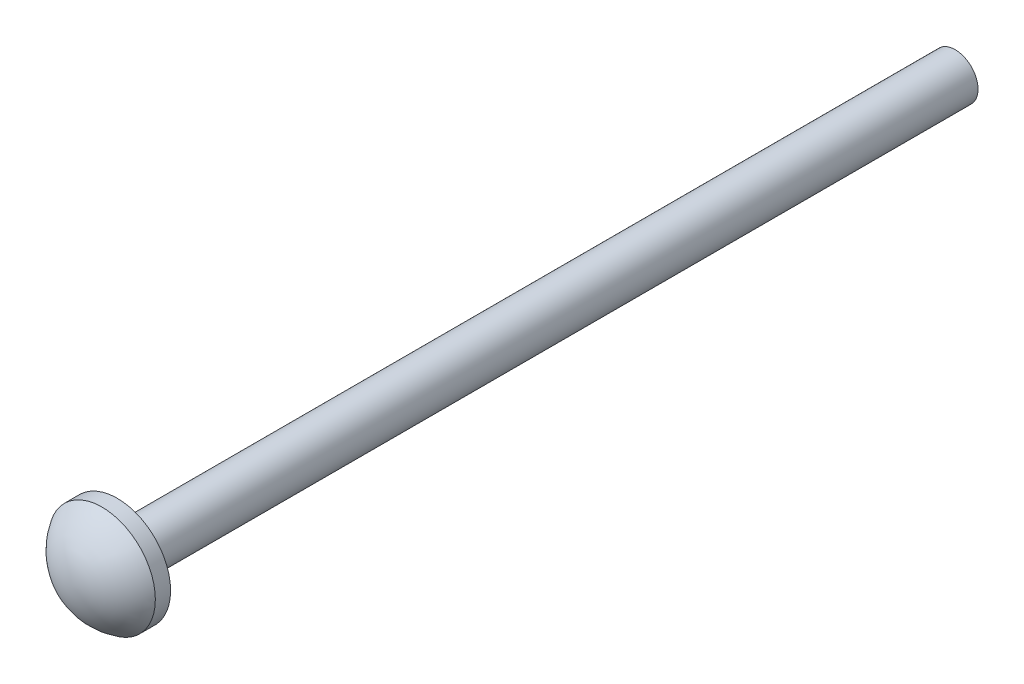
ISO-10303-21;
HEADER;
FILE_DESCRIPTION(('STEP AP214'),'2;1');
FILE_NAME('part.step','',(''),(''),'','','');
FILE_SCHEMA(('AUTOMOTIVE_DESIGN { 1 0 10303 214 1 1 1 1 }'));
ENDSEC;
DATA;
#1=APPLICATION_CONTEXT('core data for automotive mechanical design processes');
#2=APPLICATION_PROTOCOL_DEFINITION('international standard','automotive_design',2000,#1);
#3=PRODUCT_CONTEXT('',#1,'mechanical');
#4=PRODUCT('Part','Part','',(#3));
#5=PRODUCT_RELATED_PRODUCT_CATEGORY('part','',(#4));
#6=PRODUCT_DEFINITION_FORMATION('','',#4);
#7=PRODUCT_DEFINITION_CONTEXT('part definition',#1,'design');
#8=PRODUCT_DEFINITION('design','',#6,#7);
#9=PRODUCT_DEFINITION_SHAPE('','',#8);
#10=(LENGTH_UNIT() NAMED_UNIT(*) SI_UNIT(.MILLI.,.METRE.));
#11=(NAMED_UNIT(*) PLANE_ANGLE_UNIT() SI_UNIT($,.RADIAN.));
#12=(NAMED_UNIT(*) SI_UNIT($,.STERADIAN.) SOLID_ANGLE_UNIT());
#13=UNCERTAINTY_MEASURE_WITH_UNIT(LENGTH_MEASURE(1.E-05),#10,'distance_accuracy_value','');
#14=(GEOMETRIC_REPRESENTATION_CONTEXT(3) GLOBAL_UNCERTAINTY_ASSIGNED_CONTEXT((#13)) GLOBAL_UNIT_ASSIGNED_CONTEXT((#10,
#11,#12)) REPRESENTATION_CONTEXT('',''));
#15=CARTESIAN_POINT('',(0.,0.,0.));
#16=DIRECTION('',(0.,0.,1.));
#17=DIRECTION('',(1.,0.,0.));
#18=AXIS2_PLACEMENT_3D('',#15,#16,#17);
#19=CARTESIAN_POINT('',(0.,0.,1.));
#20=DIRECTION('',(0.,0.,-1.));
#21=DIRECTION('',(-1.,0.,0.));
#22=AXIS2_PLACEMENT_3D('',#19,#20,#21);
#23=CYLINDRICAL_SURFACE('',#22,3.5);
#24=CARTESIAN_POINT('',(0.,0.,1.));
#25=DIRECTION('',(0.,0.,1.));
#26=DIRECTION('',(1.,0.,0.));
#27=AXIS2_PLACEMENT_3D('',#24,#25,#26);
#28=CIRCLE('',#27,3.5);
#29=CARTESIAN_POINT('',(3.5,0.,1.));
#30=VERTEX_POINT('',#29);
#31=EDGE_CURVE('E38',#30,#30,#28,.T.);
#32=ORIENTED_EDGE('',*,*,#31,.F.);
#33=EDGE_LOOP('',(#32));
#34=FACE_BOUND('',#33,.T.);
#35=CARTESIAN_POINT('',(0.,0.,0.));
#36=DIRECTION('',(0.,0.,1.));
#37=DIRECTION('',(1.,0.,0.));
#38=AXIS2_PLACEMENT_3D('',#35,#36,#37);
#39=CIRCLE('',#38,3.5);
#40=CARTESIAN_POINT('',(3.5,0.,0.));
#41=VERTEX_POINT('',#40);
#42=EDGE_CURVE('E46',#41,#41,#39,.T.);
#43=ORIENTED_EDGE('',*,*,#42,.T.);
#44=EDGE_LOOP('',(#43));
#45=FACE_BOUND('',#44,.T.);
#46=ADVANCED_FACE('F34',(#34,#45),#23,.T.);
#47=CARTESIAN_POINT('',(0.,0.,-1.0625));
#48=DIRECTION('',(0.,0.,1.));
#49=DIRECTION('',(1.,0.,0.));
#50=AXIS2_PLACEMENT_3D('',#47,#48,#49);
#51=SPHERICAL_SURFACE('',#50,4.0625);
#52=ORIENTED_EDGE('',*,*,#31,.T.);
#53=EDGE_LOOP('',(#52));
#54=FACE_BOUND('',#53,.T.);
#55=ADVANCED_FACE('F36',(#54),#51,.T.);
#56=CARTESIAN_POINT('',(0.,0.,0.));
#57=DIRECTION('',(0.,0.,1.));
#58=DIRECTION('',(1.,0.,0.));
#59=AXIS2_PLACEMENT_3D('',#56,#57,#58);
#60=PLANE('',#59);
#61=CARTESIAN_POINT('',(0.,0.,0.));
#62=DIRECTION('',(0.,0.,-1.));
#63=DIRECTION('',(-1.,0.,0.));
#64=AXIS2_PLACEMENT_3D('',#61,#62,#63);
#65=CIRCLE('',#64,1.5);
#66=CARTESIAN_POINT('',(-1.5,0.,0.));
#67=VERTEX_POINT('',#66);
#68=EDGE_CURVE('E10',#67,#67,#65,.T.);
#69=ORIENTED_EDGE('',*,*,#68,.F.);
#70=EDGE_LOOP('',(#69));
#71=FACE_BOUND('',#70,.T.);
#72=ORIENTED_EDGE('',*,*,#42,.F.);
#73=EDGE_LOOP('',(#72));
#74=FACE_BOUND('',#73,.T.);
#75=ADVANCED_FACE('F59',(#71,#74),#60,.F.);
#76=CARTESIAN_POINT('',(0.,0.,-55.));
#77=DIRECTION('',(0.,0.,1.));
#78=DIRECTION('',(1.,0.,0.));
#79=AXIS2_PLACEMENT_3D('',#76,#77,#78);
#80=CYLINDRICAL_SURFACE('',#79,1.5);
#81=CARTESIAN_POINT('',(0.,0.,-55.));
#82=DIRECTION('',(0.,0.,-1.));
#83=DIRECTION('',(-1.,0.,0.));
#84=AXIS2_PLACEMENT_3D('',#81,#82,#83);
#85=CIRCLE('',#84,1.5);
#86=CARTESIAN_POINT('',(-1.5,0.,-55.));
#87=VERTEX_POINT('',#86);
#88=EDGE_CURVE('E48',#87,#87,#85,.T.);
#89=ORIENTED_EDGE('',*,*,#88,.F.);
#90=EDGE_LOOP('',(#89));
#91=FACE_BOUND('',#90,.T.);
#92=ORIENTED_EDGE('',*,*,#68,.T.);
#93=EDGE_LOOP('',(#92));
#94=FACE_BOUND('',#93,.T.);
#95=ADVANCED_FACE('F57',(#91,#94),#80,.T.);
#96=CARTESIAN_POINT('',(0.,0.,-55.));
#97=DIRECTION('',(0.,0.,-1.));
#98=DIRECTION('',(-1.,0.,0.));
#99=AXIS2_PLACEMENT_3D('',#96,#97,#98);
#100=PLANE('',#99);
#101=ORIENTED_EDGE('',*,*,#88,.T.);
#102=EDGE_LOOP('',(#101));
#103=FACE_BOUND('',#102,.T.);
#104=ADVANCED_FACE('F55',(#103),#100,.T.);
#105=CLOSED_SHELL('',(#46,#55,#75,#95,#104));
#106=MANIFOLD_SOLID_BREP('B2',#105);
#107=ADVANCED_BREP_SHAPE_REPRESENTATION('',(#18,#106),#14);
#108=SHAPE_DEFINITION_REPRESENTATION(#9,#107);
ENDSEC;
END-ISO-10303-21;
